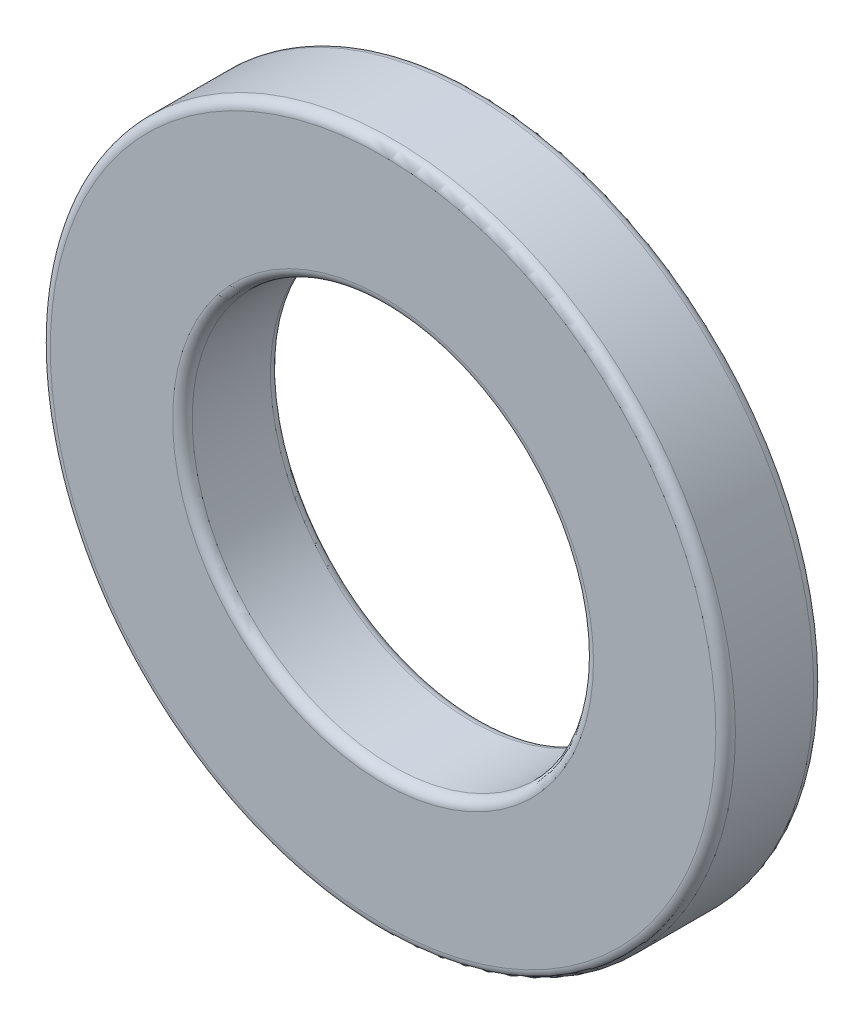
ISO-10303-21;
HEADER;
FILE_DESCRIPTION(('STEP AP214'),'2;1');
FILE_NAME('part.step','',(''),(''),'','','');
FILE_SCHEMA(('AUTOMOTIVE_DESIGN { 1 0 10303 214 1 1 1 1 }'));
ENDSEC;
DATA;
#1=APPLICATION_CONTEXT('core data for automotive mechanical design processes');
#2=APPLICATION_PROTOCOL_DEFINITION('international standard','automotive_design',2000,#1);
#3=PRODUCT_CONTEXT('',#1,'mechanical');
#4=PRODUCT('Part','Part','',(#3));
#5=PRODUCT_RELATED_PRODUCT_CATEGORY('part','',(#4));
#6=PRODUCT_DEFINITION_FORMATION('','',#4);
#7=PRODUCT_DEFINITION_CONTEXT('part definition',#1,'design');
#8=PRODUCT_DEFINITION('design','',#6,#7);
#9=PRODUCT_DEFINITION_SHAPE('','',#8);
#10=(LENGTH_UNIT() NAMED_UNIT(*) SI_UNIT(.MILLI.,.METRE.));
#11=(NAMED_UNIT(*) PLANE_ANGLE_UNIT() SI_UNIT($,.RADIAN.));
#12=(NAMED_UNIT(*) SI_UNIT($,.STERADIAN.) SOLID_ANGLE_UNIT());
#13=UNCERTAINTY_MEASURE_WITH_UNIT(LENGTH_MEASURE(1.E-05),#10,'distance_accuracy_value','');
#14=(GEOMETRIC_REPRESENTATION_CONTEXT(3) GLOBAL_UNCERTAINTY_ASSIGNED_CONTEXT((#13)) GLOBAL_UNIT_ASSIGNED_CONTEXT((#10,
#11,#12)) REPRESENTATION_CONTEXT('',''));
#15=CARTESIAN_POINT('',(0.,0.,0.));
#16=DIRECTION('',(0.,0.,1.));
#17=DIRECTION('',(1.,0.,0.));
#18=AXIS2_PLACEMENT_3D('',#15,#16,#17);
#19=CARTESIAN_POINT('',(0.,0.,2.));
#20=DIRECTION('',(0.,0.,1.));
#21=DIRECTION('',(1.,0.,0.));
#22=AXIS2_PLACEMENT_3D('',#19,#20,#21);
#23=PLANE('',#22);
#24=CARTESIAN_POINT('',(0.,0.,2.));
#25=DIRECTION('',(0.,0.,1.));
#26=DIRECTION('',(1.,0.,0.));
#27=AXIS2_PLACEMENT_3D('',#24,#25,#26);
#28=CIRCLE('',#27,4.3);
#29=CARTESIAN_POINT('',(4.3,0.,2.));
#30=VERTEX_POINT('',#29);
#31=EDGE_CURVE('E10',#30,#30,#28,.F.);
#32=ORIENTED_EDGE('',*,*,#31,.T.);
#33=EDGE_LOOP('',(#32));
#34=FACE_BOUND('',#33,.T.);
#35=CARTESIAN_POINT('',(0.,0.,2.));
#36=DIRECTION('',(0.,0.,1.));
#37=DIRECTION('',(1.,0.,0.));
#38=AXIS2_PLACEMENT_3D('',#35,#36,#37);
#39=CIRCLE('',#38,6.8);
#40=CARTESIAN_POINT('',(6.8,0.,2.));
#41=VERTEX_POINT('',#40);
#42=EDGE_CURVE('E38',#41,#41,#39,.T.);
#43=ORIENTED_EDGE('',*,*,#42,.T.);
#44=EDGE_LOOP('',(#43));
#45=FACE_BOUND('',#44,.T.);
#46=ADVANCED_FACE('F31',(#34,#45),#23,.T.);
#47=CARTESIAN_POINT('',(0.,0.,0.));
#48=DIRECTION('',(0.,0.,1.));
#49=DIRECTION('',(1.,0.,0.));
#50=AXIS2_PLACEMENT_3D('',#47,#48,#49);
#51=PLANE('',#50);
#52=CARTESIAN_POINT('',(0.,0.,0.));
#53=DIRECTION('',(0.,0.,1.));
#54=DIRECTION('',(1.,0.,0.));
#55=AXIS2_PLACEMENT_3D('',#52,#53,#54);
#56=CIRCLE('',#55,4.3);
#57=CARTESIAN_POINT('',(4.3,0.,0.));
#58=VERTEX_POINT('',#57);
#59=EDGE_CURVE('E57',#58,#58,#56,.T.);
#60=ORIENTED_EDGE('',*,*,#59,.T.);
#61=EDGE_LOOP('',(#60));
#62=FACE_BOUND('',#61,.T.);
#63=CARTESIAN_POINT('',(0.,0.,0.));
#64=DIRECTION('',(0.,0.,1.));
#65=DIRECTION('',(1.,0.,0.));
#66=AXIS2_PLACEMENT_3D('',#63,#64,#65);
#67=CIRCLE('',#66,6.8);
#68=CARTESIAN_POINT('',(6.8,0.,0.));
#69=VERTEX_POINT('',#68);
#70=EDGE_CURVE('E60',#69,#69,#67,.F.);
#71=ORIENTED_EDGE('',*,*,#70,.T.);
#72=EDGE_LOOP('',(#71));
#73=FACE_BOUND('',#72,.T.);
#74=ADVANCED_FACE('F64',(#62,#73),#51,.F.);
#75=CARTESIAN_POINT('',(0.,0.,2.));
#76=DIRECTION('',(0.,0.,-1.));
#77=DIRECTION('',(-1.,0.,0.));
#78=AXIS2_PLACEMENT_3D('',#75,#76,#77);
#79=CYLINDRICAL_SURFACE('',#78,7.);
#80=CARTESIAN_POINT('',(0.,0.,0.2));
#81=DIRECTION('',(0.,0.,1.));
#82=DIRECTION('',(1.,0.,0.));
#83=AXIS2_PLACEMENT_3D('',#80,#81,#82);
#84=CIRCLE('',#83,7.);
#85=CARTESIAN_POINT('',(7.,0.,0.2));
#86=VERTEX_POINT('',#85);
#87=EDGE_CURVE('E42',#86,#86,#84,.T.);
#88=ORIENTED_EDGE('',*,*,#87,.T.);
#89=EDGE_LOOP('',(#88));
#90=FACE_BOUND('',#89,.T.);
#91=CARTESIAN_POINT('',(0.,0.,1.8));
#92=DIRECTION('',(0.,0.,1.));
#93=DIRECTION('',(1.,0.,0.));
#94=AXIS2_PLACEMENT_3D('',#91,#92,#93);
#95=CIRCLE('',#94,7.);
#96=CARTESIAN_POINT('',(7.,0.,1.8));
#97=VERTEX_POINT('',#96);
#98=EDGE_CURVE('E46',#97,#97,#95,.F.);
#99=ORIENTED_EDGE('',*,*,#98,.T.);
#100=EDGE_LOOP('',(#99));
#101=FACE_BOUND('',#100,.T.);
#102=ADVANCED_FACE('F74',(#90,#101),#79,.T.);
#103=CARTESIAN_POINT('',(0.,0.,2.));
#104=DIRECTION('',(0.,0.,-1.));
#105=DIRECTION('',(-1.,0.,0.));
#106=AXIS2_PLACEMENT_3D('',#103,#104,#105);
#107=CYLINDRICAL_SURFACE('',#106,4.1);
#108=CARTESIAN_POINT('',(0.,0.,0.2));
#109=DIRECTION('',(0.,0.,1.));
#110=DIRECTION('',(1.,0.,0.));
#111=AXIS2_PLACEMENT_3D('',#108,#109,#110);
#112=CIRCLE('',#111,4.1);
#113=CARTESIAN_POINT('',(4.1,0.,0.2));
#114=VERTEX_POINT('',#113);
#115=EDGE_CURVE('E51',#114,#114,#112,.F.);
#116=ORIENTED_EDGE('',*,*,#115,.T.);
#117=EDGE_LOOP('',(#116));
#118=FACE_BOUND('',#117,.T.);
#119=CARTESIAN_POINT('',(0.,0.,1.8));
#120=DIRECTION('',(0.,0.,1.));
#121=DIRECTION('',(1.,0.,0.));
#122=AXIS2_PLACEMENT_3D('',#119,#120,#121);
#123=CIRCLE('',#122,4.1);
#124=CARTESIAN_POINT('',(4.1,0.,1.8));
#125=VERTEX_POINT('',#124);
#126=EDGE_CURVE('E54',#125,#125,#123,.T.);
#127=ORIENTED_EDGE('',*,*,#126,.T.);
#128=EDGE_LOOP('',(#127));
#129=FACE_BOUND('',#128,.T.);
#130=ADVANCED_FACE('F77',(#118,#129),#107,.F.);
#131=CARTESIAN_POINT('',(0.,0.,0.2));
#132=DIRECTION('',(0.,0.,1.));
#133=DIRECTION('',(1.,0.,0.));
#134=AXIS2_PLACEMENT_3D('',#131,#132,#133);
#135=TOROIDAL_SURFACE('',#134,4.3,0.2);
#136=ORIENTED_EDGE('',*,*,#115,.F.);
#137=EDGE_LOOP('',(#136));
#138=FACE_BOUND('',#137,.T.);
#139=ORIENTED_EDGE('',*,*,#59,.F.);
#140=EDGE_LOOP('',(#139));
#141=FACE_BOUND('',#140,.T.);
#142=ADVANCED_FACE('F70',(#138,#141),#135,.T.);
#143=CARTESIAN_POINT('',(0.,0.,0.2));
#144=DIRECTION('',(0.,0.,1.));
#145=DIRECTION('',(1.,0.,0.));
#146=AXIS2_PLACEMENT_3D('',#143,#144,#145);
#147=TOROIDAL_SURFACE('',#146,6.8,0.2);
#148=ORIENTED_EDGE('',*,*,#70,.F.);
#149=EDGE_LOOP('',(#148));
#150=FACE_BOUND('',#149,.T.);
#151=ORIENTED_EDGE('',*,*,#87,.F.);
#152=EDGE_LOOP('',(#151));
#153=FACE_BOUND('',#152,.T.);
#154=ADVANCED_FACE('F66',(#150,#153),#147,.T.);
#155=CARTESIAN_POINT('',(0.,0.,1.8));
#156=DIRECTION('',(0.,0.,1.));
#157=DIRECTION('',(1.,0.,0.));
#158=AXIS2_PLACEMENT_3D('',#155,#156,#157);
#159=TOROIDAL_SURFACE('',#158,4.3,0.2);
#160=ORIENTED_EDGE('',*,*,#31,.F.);
#161=EDGE_LOOP('',(#160));
#162=FACE_BOUND('',#161,.T.);
#163=ORIENTED_EDGE('',*,*,#126,.F.);
#164=EDGE_LOOP('',(#163));
#165=FACE_BOUND('',#164,.T.);
#166=ADVANCED_FACE('F69',(#162,#165),#159,.T.);
#167=CARTESIAN_POINT('',(0.,0.,1.8));
#168=DIRECTION('',(0.,0.,1.));
#169=DIRECTION('',(1.,0.,0.));
#170=AXIS2_PLACEMENT_3D('',#167,#168,#169);
#171=TOROIDAL_SURFACE('',#170,6.8,0.2);
#172=ORIENTED_EDGE('',*,*,#98,.F.);
#173=EDGE_LOOP('',(#172));
#174=FACE_BOUND('',#173,.T.);
#175=ORIENTED_EDGE('',*,*,#42,.F.);
#176=EDGE_LOOP('',(#175));
#177=FACE_BOUND('',#176,.T.);
#178=ADVANCED_FACE('F33',(#174,#177),#171,.T.);
#179=CLOSED_SHELL('',(#46,#74,#102,#130,#142,#154,#166,#178));
#180=MANIFOLD_SOLID_BREP('B2',#179);
#181=ADVANCED_BREP_SHAPE_REPRESENTATION('',(#18,#180),#14);
#182=SHAPE_DEFINITION_REPRESENTATION(#9,#181);
ENDSEC;
END-ISO-10303-21;
